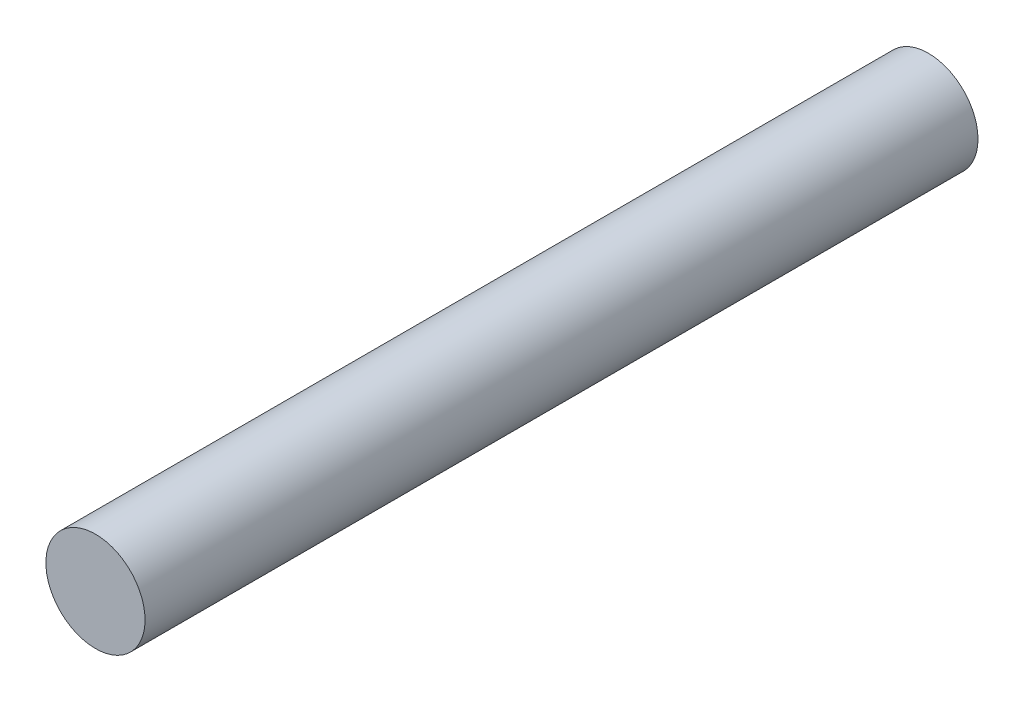
ISO-10303-21;
HEADER;
FILE_DESCRIPTION(('STEP AP214'),'2;1');
FILE_NAME('part.step','',(''),(''),'','','');
FILE_SCHEMA(('AUTOMOTIVE_DESIGN { 1 0 10303 214 1 1 1 1 }'));
ENDSEC;
DATA;
#1=APPLICATION_CONTEXT('core data for automotive mechanical design processes');
#2=APPLICATION_PROTOCOL_DEFINITION('international standard','automotive_design',2000,#1);
#3=PRODUCT_CONTEXT('',#1,'mechanical');
#4=PRODUCT('Part','Part','',(#3));
#5=PRODUCT_RELATED_PRODUCT_CATEGORY('part','',(#4));
#6=PRODUCT_DEFINITION_FORMATION('','',#4);
#7=PRODUCT_DEFINITION_CONTEXT('part definition',#1,'design');
#8=PRODUCT_DEFINITION('design','',#6,#7);
#9=PRODUCT_DEFINITION_SHAPE('','',#8);
#10=(LENGTH_UNIT() NAMED_UNIT(*) SI_UNIT(.MILLI.,.METRE.));
#11=(NAMED_UNIT(*) PLANE_ANGLE_UNIT() SI_UNIT($,.RADIAN.));
#12=(NAMED_UNIT(*) SI_UNIT($,.STERADIAN.) SOLID_ANGLE_UNIT());
#13=UNCERTAINTY_MEASURE_WITH_UNIT(LENGTH_MEASURE(1.E-05),#10,'distance_accuracy_value','');
#14=(GEOMETRIC_REPRESENTATION_CONTEXT(3) GLOBAL_UNCERTAINTY_ASSIGNED_CONTEXT((#13)) GLOBAL_UNIT_ASSIGNED_CONTEXT((#10,
#11,#12)) REPRESENTATION_CONTEXT('',''));
#15=CARTESIAN_POINT('',(0.,0.,0.));
#16=DIRECTION('',(0.,0.,1.));
#17=DIRECTION('',(1.,0.,0.));
#18=AXIS2_PLACEMENT_3D('',#15,#16,#17);
#19=CARTESIAN_POINT('',(-8.7667270700183,13.0587705313814,42.));
#20=DIRECTION('',(0.,0.,-1.));
#21=DIRECTION('',(-1.,0.,0.));
#22=AXIS2_PLACEMENT_3D('',#19,#20,#21);
#23=CYLINDRICAL_SURFACE('',#22,2.5);
#24=CARTESIAN_POINT('',(-8.7667270700183,13.0587705313814,42.));
#25=DIRECTION('',(0.,0.,1.));
#26=DIRECTION('',(1.,0.,0.));
#27=AXIS2_PLACEMENT_3D('',#24,#25,#26);
#28=CIRCLE('',#27,2.5);
#29=CARTESIAN_POINT('',(-6.2667270700183,13.0587705313814,42.));
#30=VERTEX_POINT('',#29);
#31=EDGE_CURVE('E10',#30,#30,#28,.T.);
#32=ORIENTED_EDGE('',*,*,#31,.F.);
#33=EDGE_LOOP('',(#32));
#34=FACE_BOUND('',#33,.T.);
#35=CARTESIAN_POINT('',(-8.7667270700183,13.0587705313814,0.));
#36=DIRECTION('',(0.,0.,1.));
#37=DIRECTION('',(1.,0.,0.));
#38=AXIS2_PLACEMENT_3D('',#35,#36,#37);
#39=CIRCLE('',#38,2.5);
#40=CARTESIAN_POINT('',(-6.2667270700183,13.0587705313814,0.));
#41=VERTEX_POINT('',#40);
#42=EDGE_CURVE('E40',#41,#41,#39,.T.);
#43=ORIENTED_EDGE('',*,*,#42,.T.);
#44=EDGE_LOOP('',(#43));
#45=FACE_BOUND('',#44,.T.);
#46=ADVANCED_FACE('F37',(#34,#45),#23,.T.);
#47=CARTESIAN_POINT('',(-8.7667270700183,13.0587705313814,42.));
#48=DIRECTION('',(0.,0.,1.));
#49=DIRECTION('',(1.,0.,0.));
#50=AXIS2_PLACEMENT_3D('',#47,#48,#49);
#51=PLANE('',#50);
#52=ORIENTED_EDGE('',*,*,#31,.T.);
#53=EDGE_LOOP('',(#52));
#54=FACE_BOUND('',#53,.T.);
#55=ADVANCED_FACE('F54',(#54),#51,.T.);
#56=CARTESIAN_POINT('',(-8.7667270700183,13.0587705313814,0.));
#57=DIRECTION('',(0.,0.,1.));
#58=DIRECTION('',(1.,0.,0.));
#59=AXIS2_PLACEMENT_3D('',#56,#57,#58);
#60=PLANE('',#59);
#61=ORIENTED_EDGE('',*,*,#42,.F.);
#62=EDGE_LOOP('',(#61));
#63=FACE_BOUND('',#62,.T.);
#64=ADVANCED_FACE('F52',(#63),#60,.F.);
#65=CLOSED_SHELL('',(#46,#55,#64));
#66=MANIFOLD_SOLID_BREP('B2',#65);
#67=ADVANCED_BREP_SHAPE_REPRESENTATION('',(#18,#66),#14);
#68=SHAPE_DEFINITION_REPRESENTATION(#9,#67);
ENDSEC;
END-ISO-10303-21;
